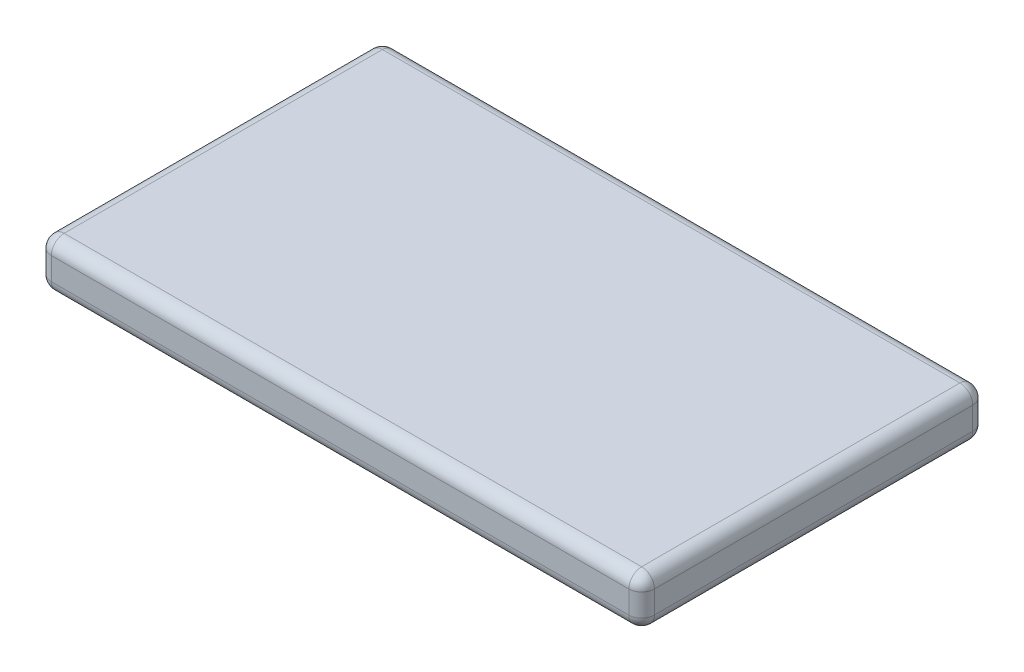
ISO-10303-21;
HEADER;
FILE_DESCRIPTION(('STEP AP214'),'2;1');
FILE_NAME('part.step','',(''),(''),'','','');
FILE_SCHEMA(('AUTOMOTIVE_DESIGN { 1 0 10303 214 1 1 1 1 }'));
ENDSEC;
DATA;
#1=APPLICATION_CONTEXT('core data for automotive mechanical design processes');
#2=APPLICATION_PROTOCOL_DEFINITION('international standard','automotive_design',2000,#1);
#3=PRODUCT_CONTEXT('',#1,'mechanical');
#4=PRODUCT('Part','Part','',(#3));
#5=PRODUCT_RELATED_PRODUCT_CATEGORY('part','',(#4));
#6=PRODUCT_DEFINITION_FORMATION('','',#4);
#7=PRODUCT_DEFINITION_CONTEXT('part definition',#1,'design');
#8=PRODUCT_DEFINITION('design','',#6,#7);
#9=PRODUCT_DEFINITION_SHAPE('','',#8);
#10=(LENGTH_UNIT() NAMED_UNIT(*) SI_UNIT(.MILLI.,.METRE.));
#11=(NAMED_UNIT(*) PLANE_ANGLE_UNIT() SI_UNIT($,.RADIAN.));
#12=(NAMED_UNIT(*) SI_UNIT($,.STERADIAN.) SOLID_ANGLE_UNIT());
#13=UNCERTAINTY_MEASURE_WITH_UNIT(LENGTH_MEASURE(1.E-05),#10,'distance_accuracy_value','');
#14=(GEOMETRIC_REPRESENTATION_CONTEXT(3) GLOBAL_UNCERTAINTY_ASSIGNED_CONTEXT((#13)) GLOBAL_UNIT_ASSIGNED_CONTEXT((#10,
#11,#12)) REPRESENTATION_CONTEXT('',''));
#15=CARTESIAN_POINT('',(0.,0.,0.));
#16=DIRECTION('',(0.,0.,1.));
#17=DIRECTION('',(1.,0.,0.));
#18=AXIS2_PLACEMENT_3D('',#15,#16,#17);
#19=CARTESIAN_POINT('',(0.,4.7752,0.));
#20=DIRECTION('',(1.,0.,0.));
#21=DIRECTION('',(0.,0.,-1.));
#22=AXIS2_PLACEMENT_3D('',#19,#20,#21);
#23=PLANE('',#22);
#24=DIRECTION('',(0.,0.,1.));
#25=VECTOR('',#24,1.);
#26=CARTESIAN_POINT('',(0.,3.5052,0.));
#27=LINE('',#26,#25);
#28=CARTESIAN_POINT('',(0.,3.5052,-1.27));
#29=VERTEX_POINT('',#28);
#30=CARTESIAN_POINT('',(0.,3.5052,-32.766));
#31=VERTEX_POINT('',#30);
#32=EDGE_CURVE('E129',#29,#31,#27,.F.);
#33=ORIENTED_EDGE('',*,*,#32,.T.);
#34=DIRECTION('',(0.,-1.,0.));
#35=VECTOR('',#34,1.);
#36=CARTESIAN_POINT('',(0.,4.7752,-32.766));
#37=LINE('',#36,#35);
#38=CARTESIAN_POINT('',(0.,1.27,-32.766));
#39=VERTEX_POINT('',#38);
#40=EDGE_CURVE('E165',#31,#39,#37,.T.);
#41=ORIENTED_EDGE('',*,*,#40,.T.);
#42=DIRECTION('',(0.,0.,1.));
#43=VECTOR('',#42,1.);
#44=CARTESIAN_POINT('',(0.,1.27,0.));
#45=LINE('',#44,#43);
#46=CARTESIAN_POINT('',(0.,1.27,-1.27));
#47=VERTEX_POINT('',#46);
#48=EDGE_CURVE('E158',#39,#47,#45,.T.);
#49=ORIENTED_EDGE('',*,*,#48,.T.);
#50=DIRECTION('',(0.,-1.,0.));
#51=VECTOR('',#50,1.);
#52=CARTESIAN_POINT('',(0.,4.7752,-1.27));
#53=LINE('',#52,#51);
#54=EDGE_CURVE('E156',#47,#29,#53,.F.);
#55=ORIENTED_EDGE('',*,*,#54,.T.);
#56=EDGE_LOOP('',(#33,#41,#49,#55));
#57=FACE_BOUND('',#56,.T.);
#58=ADVANCED_FACE('F33',(#57),#23,.F.);
#59=CARTESIAN_POINT('',(0.,4.7752,0.));
#60=DIRECTION('',(0.,0.,-1.));
#61=DIRECTION('',(-1.,0.,0.));
#62=AXIS2_PLACEMENT_3D('',#59,#60,#61);
#63=PLANE('',#62);
#64=DIRECTION('',(1.,0.,0.));
#65=VECTOR('',#64,1.);
#66=CARTESIAN_POINT('',(0.,3.5052,0.));
#67=LINE('',#66,#65);
#68=CARTESIAN_POINT('',(58.42,3.5052,0.));
#69=VERTEX_POINT('',#68);
#70=CARTESIAN_POINT('',(1.27,3.5052,0.));
#71=VERTEX_POINT('',#70);
#72=EDGE_CURVE('E42',#69,#71,#67,.F.);
#73=ORIENTED_EDGE('',*,*,#72,.T.);
#74=DIRECTION('',(0.,-1.,0.));
#75=VECTOR('',#74,1.);
#76=CARTESIAN_POINT('',(1.27,4.7752,0.));
#77=LINE('',#76,#75);
#78=CARTESIAN_POINT('',(1.27,1.27,0.));
#79=VERTEX_POINT('',#78);
#80=EDGE_CURVE('E11',#71,#79,#77,.T.);
#81=ORIENTED_EDGE('',*,*,#80,.T.);
#82=DIRECTION('',(1.,0.,0.));
#83=VECTOR('',#82,1.);
#84=CARTESIAN_POINT('',(59.69,1.27,0.));
#85=LINE('',#84,#83);
#86=CARTESIAN_POINT('',(58.42,1.27,0.));
#87=VERTEX_POINT('',#86);
#88=EDGE_CURVE('E194',#79,#87,#85,.T.);
#89=ORIENTED_EDGE('',*,*,#88,.T.);
#90=DIRECTION('',(0.,-1.,0.));
#91=VECTOR('',#90,1.);
#92=CARTESIAN_POINT('',(58.42,4.7752,0.));
#93=LINE('',#92,#91);
#94=EDGE_CURVE('E53',#87,#69,#93,.F.);
#95=ORIENTED_EDGE('',*,*,#94,.T.);
#96=EDGE_LOOP('',(#73,#81,#89,#95));
#97=FACE_BOUND('',#96,.T.);
#98=ADVANCED_FACE('F327',(#97),#63,.F.);
#99=CARTESIAN_POINT('',(59.69,4.7752,0.));
#100=DIRECTION('',(-1.,0.,0.));
#101=DIRECTION('',(0.,0.,1.));
#102=AXIS2_PLACEMENT_3D('',#99,#100,#101);
#103=PLANE('',#102);
#104=DIRECTION('',(0.,-1.,0.));
#105=VECTOR('',#104,1.);
#106=CARTESIAN_POINT('',(59.69,4.7752,-32.766));
#107=LINE('',#106,#105);
#108=CARTESIAN_POINT('',(59.69,1.27,-32.766));
#109=VERTEX_POINT('',#108);
#110=CARTESIAN_POINT('',(59.69,3.5052,-32.766));
#111=VERTEX_POINT('',#110);
#112=EDGE_CURVE('E189',#109,#111,#107,.F.);
#113=ORIENTED_EDGE('',*,*,#112,.T.);
#114=DIRECTION('',(0.,0.,-1.));
#115=VECTOR('',#114,1.);
#116=CARTESIAN_POINT('',(59.69,3.5052,0.));
#117=LINE('',#116,#115);
#118=CARTESIAN_POINT('',(59.69,3.5052,-1.27));
#119=VERTEX_POINT('',#118);
#120=EDGE_CURVE('E191',#111,#119,#117,.F.);
#121=ORIENTED_EDGE('',*,*,#120,.T.);
#122=DIRECTION('',(0.,-1.,0.));
#123=VECTOR('',#122,1.);
#124=CARTESIAN_POINT('',(59.69,4.7752,-1.27));
#125=LINE('',#124,#123);
#126=CARTESIAN_POINT('',(59.69,1.27,-1.27));
#127=VERTEX_POINT('',#126);
#128=EDGE_CURVE('E185',#119,#127,#125,.T.);
#129=ORIENTED_EDGE('',*,*,#128,.T.);
#130=DIRECTION('',(0.,0.,-1.));
#131=VECTOR('',#130,1.);
#132=CARTESIAN_POINT('',(59.69,1.27,-34.036));
#133=LINE('',#132,#131);
#134=EDGE_CURVE('E187',#127,#109,#133,.T.);
#135=ORIENTED_EDGE('',*,*,#134,.T.);
#136=EDGE_LOOP('',(#113,#121,#129,#135));
#137=FACE_BOUND('',#136,.T.);
#138=ADVANCED_FACE('F278',(#137),#103,.F.);
#139=CARTESIAN_POINT('',(0.,4.7752,-34.036));
#140=DIRECTION('',(0.,0.,1.));
#141=DIRECTION('',(1.,0.,0.));
#142=AXIS2_PLACEMENT_3D('',#139,#140,#141);
#143=PLANE('',#142);
#144=DIRECTION('',(0.,-1.,0.));
#145=VECTOR('',#144,1.);
#146=CARTESIAN_POINT('',(1.27,4.7752,-34.036));
#147=LINE('',#146,#145);
#148=CARTESIAN_POINT('',(1.27,1.27,-34.036));
#149=VERTEX_POINT('',#148);
#150=CARTESIAN_POINT('',(1.27,3.5052,-34.036));
#151=VERTEX_POINT('',#150);
#152=EDGE_CURVE('E180',#149,#151,#147,.F.);
#153=ORIENTED_EDGE('',*,*,#152,.T.);
#154=DIRECTION('',(-1.,0.,0.));
#155=VECTOR('',#154,1.);
#156=CARTESIAN_POINT('',(0.,3.5052,-34.036));
#157=LINE('',#156,#155);
#158=CARTESIAN_POINT('',(58.42,3.5052,-34.036));
#159=VERTEX_POINT('',#158);
#160=EDGE_CURVE('E182',#151,#159,#157,.F.);
#161=ORIENTED_EDGE('',*,*,#160,.T.);
#162=DIRECTION('',(0.,-1.,0.));
#163=VECTOR('',#162,1.);
#164=CARTESIAN_POINT('',(58.42,4.7752,-34.036));
#165=LINE('',#164,#163);
#166=CARTESIAN_POINT('',(58.42,1.27,-34.036));
#167=VERTEX_POINT('',#166);
#168=EDGE_CURVE('E176',#159,#167,#165,.T.);
#169=ORIENTED_EDGE('',*,*,#168,.T.);
#170=DIRECTION('',(-1.,0.,0.));
#171=VECTOR('',#170,1.);
#172=CARTESIAN_POINT('',(0.,1.27,-34.036));
#173=LINE('',#172,#171);
#174=EDGE_CURVE('E178',#167,#149,#173,.T.);
#175=ORIENTED_EDGE('',*,*,#174,.T.);
#176=EDGE_LOOP('',(#153,#161,#169,#175));
#177=FACE_BOUND('',#176,.T.);
#178=ADVANCED_FACE('F269',(#177),#143,.F.);
#179=CARTESIAN_POINT('',(0.,4.7752,0.));
#180=DIRECTION('',(0.,-1.,0.));
#181=DIRECTION('',(0.,0.,-1.));
#182=AXIS2_PLACEMENT_3D('',#179,#180,#181);
#183=PLANE('',#182);
#184=DIRECTION('',(-1.,0.,0.));
#185=VECTOR('',#184,1.);
#186=CARTESIAN_POINT('',(0.,4.7752,-32.766));
#187=LINE('',#186,#185);
#188=CARTESIAN_POINT('',(58.42,4.7752,-32.766));
#189=VERTEX_POINT('',#188);
#190=CARTESIAN_POINT('',(1.27,4.7752,-32.766));
#191=VERTEX_POINT('',#190);
#192=EDGE_CURVE('E154',#189,#191,#187,.T.);
#193=ORIENTED_EDGE('',*,*,#192,.T.);
#194=DIRECTION('',(0.,0.,1.));
#195=VECTOR('',#194,1.);
#196=CARTESIAN_POINT('',(1.27,4.7752,0.));
#197=LINE('',#196,#195);
#198=CARTESIAN_POINT('',(1.27,4.7752,-1.27));
#199=VERTEX_POINT('',#198);
#200=EDGE_CURVE('E127',#191,#199,#197,.T.);
#201=ORIENTED_EDGE('',*,*,#200,.T.);
#202=DIRECTION('',(1.,0.,0.));
#203=VECTOR('',#202,1.);
#204=CARTESIAN_POINT('',(0.,4.7752,-1.27));
#205=LINE('',#204,#203);
#206=CARTESIAN_POINT('',(58.42,4.7752,-1.27));
#207=VERTEX_POINT('',#206);
#208=EDGE_CURVE('E144',#199,#207,#205,.T.);
#209=ORIENTED_EDGE('',*,*,#208,.T.);
#210=DIRECTION('',(0.,0.,-1.));
#211=VECTOR('',#210,1.);
#212=CARTESIAN_POINT('',(58.42,4.7752,0.));
#213=LINE('',#212,#211);
#214=EDGE_CURVE('E150',#207,#189,#213,.T.);
#215=ORIENTED_EDGE('',*,*,#214,.T.);
#216=EDGE_LOOP('',(#193,#201,#209,#215));
#217=FACE_BOUND('',#216,.T.);
#218=ADVANCED_FACE('F152',(#217),#183,.F.);
#219=CARTESIAN_POINT('',(0.,0.,0.));
#220=DIRECTION('',(0.,-1.,0.));
#221=DIRECTION('',(0.,0.,-1.));
#222=AXIS2_PLACEMENT_3D('',#219,#220,#221);
#223=PLANE('',#222);
#224=DIRECTION('',(1.,0.,0.));
#225=VECTOR('',#224,1.);
#226=CARTESIAN_POINT('',(0.,0.,-1.27));
#227=LINE('',#226,#225);
#228=CARTESIAN_POINT('',(58.42,0.,-1.27));
#229=VERTEX_POINT('',#228);
#230=CARTESIAN_POINT('',(1.27,0.,-1.27));
#231=VERTEX_POINT('',#230);
#232=EDGE_CURVE('E167',#229,#231,#227,.F.);
#233=ORIENTED_EDGE('',*,*,#232,.T.);
#234=DIRECTION('',(0.,0.,1.));
#235=VECTOR('',#234,1.);
#236=CARTESIAN_POINT('',(1.27,0.,-34.036));
#237=LINE('',#236,#235);
#238=CARTESIAN_POINT('',(1.27,0.,-32.766));
#239=VERTEX_POINT('',#238);
#240=EDGE_CURVE('E173',#231,#239,#237,.F.);
#241=ORIENTED_EDGE('',*,*,#240,.T.);
#242=DIRECTION('',(-1.,0.,0.));
#243=VECTOR('',#242,1.);
#244=CARTESIAN_POINT('',(59.69,0.,-32.766));
#245=LINE('',#244,#243);
#246=CARTESIAN_POINT('',(58.42,0.,-32.766));
#247=VERTEX_POINT('',#246);
#248=EDGE_CURVE('E171',#239,#247,#245,.F.);
#249=ORIENTED_EDGE('',*,*,#248,.T.);
#250=DIRECTION('',(0.,0.,-1.));
#251=VECTOR('',#250,1.);
#252=CARTESIAN_POINT('',(58.42,0.,0.));
#253=LINE('',#252,#251);
#254=EDGE_CURVE('E169',#247,#229,#253,.F.);
#255=ORIENTED_EDGE('',*,*,#254,.T.);
#256=EDGE_LOOP('',(#233,#241,#249,#255));
#257=FACE_BOUND('',#256,.T.);
#258=ADVANCED_FACE('F296',(#257),#223,.T.);
#259=CARTESIAN_POINT('',(58.42,1.27,0.));
#260=DIRECTION('',(0.,0.,1.));
#261=DIRECTION('',(1.,0.,0.));
#262=AXIS2_PLACEMENT_3D('',#259,#260,#261);
#263=CYLINDRICAL_SURFACE('',#262,1.27);
#264=CARTESIAN_POINT('',(58.42,1.27,-32.766));
#265=DIRECTION('',(0.,0.,-1.));
#266=DIRECTION('',(-1.,0.,0.));
#267=AXIS2_PLACEMENT_3D('',#264,#265,#266);
#268=CIRCLE('',#267,1.27);
#269=EDGE_CURVE('E37',#109,#247,#268,.T.);
#270=ORIENTED_EDGE('',*,*,#269,.F.);
#271=ORIENTED_EDGE('',*,*,#134,.F.);
#272=CARTESIAN_POINT('',(58.42,1.27,-1.27));
#273=DIRECTION('',(0.,0.,1.));
#274=DIRECTION('',(1.,0.,0.));
#275=AXIS2_PLACEMENT_3D('',#272,#273,#274);
#276=CIRCLE('',#275,1.27);
#277=EDGE_CURVE('E246',#229,#127,#276,.T.);
#278=ORIENTED_EDGE('',*,*,#277,.F.);
#279=ORIENTED_EDGE('',*,*,#254,.F.);
#280=EDGE_LOOP('',(#270,#271,#278,#279));
#281=FACE_BOUND('',#280,.T.);
#282=ADVANCED_FACE('F35',(#281),#263,.T.);
#283=CARTESIAN_POINT('',(58.42,1.27,-32.766));
#284=DIRECTION('',(0.,0.,1.));
#285=DIRECTION('',(1.,0.,0.));
#286=AXIS2_PLACEMENT_3D('',#283,#284,#285);
#287=SPHERICAL_SURFACE('',#286,1.27);
#288=CARTESIAN_POINT('',(58.42,1.27,-32.766));
#289=DIRECTION('',(0.,-1.,0.));
#290=DIRECTION('',(0.,0.,-1.));
#291=AXIS2_PLACEMENT_3D('',#288,#289,#290);
#292=CIRCLE('',#291,1.27);
#293=EDGE_CURVE('E241',#109,#167,#292,.F.);
#294=ORIENTED_EDGE('',*,*,#293,.F.);
#295=ORIENTED_EDGE('',*,*,#269,.T.);
#296=CARTESIAN_POINT('',(58.42,1.27,-32.766));
#297=DIRECTION('',(1.,0.,0.));
#298=DIRECTION('',(0.,0.,-1.));
#299=AXIS2_PLACEMENT_3D('',#296,#297,#298);
#300=CIRCLE('',#299,1.27);
#301=EDGE_CURVE('E244',#167,#247,#300,.F.);
#302=ORIENTED_EDGE('',*,*,#301,.F.);
#303=EDGE_LOOP('',(#294,#295,#302));
#304=FACE_BOUND('',#303,.T.);
#305=ADVANCED_FACE('F257',(#304),#287,.T.);
#306=CARTESIAN_POINT('',(58.42,1.27,-1.27));
#307=DIRECTION('',(0.,0.,1.));
#308=DIRECTION('',(1.,0.,0.));
#309=AXIS2_PLACEMENT_3D('',#306,#307,#308);
#310=SPHERICAL_SURFACE('',#309,1.27);
#311=CARTESIAN_POINT('',(58.42,1.27,-1.27));
#312=DIRECTION('',(1.,0.,0.));
#313=DIRECTION('',(0.,0.,-1.));
#314=AXIS2_PLACEMENT_3D('',#311,#312,#313);
#315=CIRCLE('',#314,1.27);
#316=EDGE_CURVE('E235',#229,#87,#315,.F.);
#317=ORIENTED_EDGE('',*,*,#316,.F.);
#318=ORIENTED_EDGE('',*,*,#277,.T.);
#319=CARTESIAN_POINT('',(58.42,1.27,-1.27));
#320=DIRECTION('',(0.,-1.,0.));
#321=DIRECTION('',(0.,0.,-1.));
#322=AXIS2_PLACEMENT_3D('',#319,#320,#321);
#323=CIRCLE('',#322,1.27);
#324=EDGE_CURVE('E238',#87,#127,#323,.F.);
#325=ORIENTED_EDGE('',*,*,#324,.F.);
#326=EDGE_LOOP('',(#317,#318,#325));
#327=FACE_BOUND('',#326,.T.);
#328=ADVANCED_FACE('F289',(#327),#310,.T.);
#329=CARTESIAN_POINT('',(0.,1.27,-32.766));
#330=DIRECTION('',(1.,0.,0.));
#331=DIRECTION('',(0.,0.,-1.));
#332=AXIS2_PLACEMENT_3D('',#329,#330,#331);
#333=CYLINDRICAL_SURFACE('',#332,1.27);
#334=ORIENTED_EDGE('',*,*,#301,.T.);
#335=ORIENTED_EDGE('',*,*,#248,.F.);
#336=CARTESIAN_POINT('',(1.27,1.27,-32.766));
#337=DIRECTION('',(-1.,0.,0.));
#338=DIRECTION('',(0.,0.,1.));
#339=AXIS2_PLACEMENT_3D('',#336,#337,#338);
#340=CIRCLE('',#339,1.27);
#341=EDGE_CURVE('E230',#149,#239,#340,.T.);
#342=ORIENTED_EDGE('',*,*,#341,.F.);
#343=ORIENTED_EDGE('',*,*,#174,.F.);
#344=EDGE_LOOP('',(#334,#335,#342,#343));
#345=FACE_BOUND('',#344,.T.);
#346=ADVANCED_FACE('F265',(#345),#333,.T.);
#347=CARTESIAN_POINT('',(58.42,4.7752,-32.766));
#348=DIRECTION('',(0.,-1.,0.));
#349=DIRECTION('',(0.,0.,-1.));
#350=AXIS2_PLACEMENT_3D('',#347,#348,#349);
#351=CYLINDRICAL_SURFACE('',#350,1.27);
#352=ORIENTED_EDGE('',*,*,#293,.T.);
#353=ORIENTED_EDGE('',*,*,#168,.F.);
#354=CARTESIAN_POINT('',(58.42,3.5052,-32.766));
#355=DIRECTION('',(0.,1.,0.));
#356=DIRECTION('',(0.,0.,1.));
#357=AXIS2_PLACEMENT_3D('',#354,#355,#356);
#358=CIRCLE('',#357,1.27);
#359=EDGE_CURVE('E227',#111,#159,#358,.T.);
#360=ORIENTED_EDGE('',*,*,#359,.F.);
#361=ORIENTED_EDGE('',*,*,#112,.F.);
#362=EDGE_LOOP('',(#352,#353,#360,#361));
#363=FACE_BOUND('',#362,.T.);
#364=ADVANCED_FACE('F275',(#363),#351,.T.);
#365=CARTESIAN_POINT('',(58.42,3.5052,0.));
#366=DIRECTION('',(0.,0.,-1.));
#367=DIRECTION('',(-1.,0.,0.));
#368=AXIS2_PLACEMENT_3D('',#365,#366,#367);
#369=CYLINDRICAL_SURFACE('',#368,1.27);
#370=CARTESIAN_POINT('',(58.42,3.5052,-1.27));
#371=DIRECTION('',(0.,0.,1.));
#372=DIRECTION('',(1.,0.,0.));
#373=AXIS2_PLACEMENT_3D('',#370,#371,#372);
#374=CIRCLE('',#373,1.27);
#375=EDGE_CURVE('E221',#119,#207,#374,.T.);
#376=ORIENTED_EDGE('',*,*,#375,.F.);
#377=ORIENTED_EDGE('',*,*,#120,.F.);
#378=CARTESIAN_POINT('',(58.42,3.5052,-32.766));
#379=DIRECTION('',(0.,0.,-1.));
#380=DIRECTION('',(-1.,0.,0.));
#381=AXIS2_PLACEMENT_3D('',#378,#379,#380);
#382=CIRCLE('',#381,1.27);
#383=EDGE_CURVE('E224',#189,#111,#382,.T.);
#384=ORIENTED_EDGE('',*,*,#383,.F.);
#385=ORIENTED_EDGE('',*,*,#214,.F.);
#386=EDGE_LOOP('',(#376,#377,#384,#385));
#387=FACE_BOUND('',#386,.T.);
#388=ADVANCED_FACE('F282',(#387),#369,.T.);
#389=CARTESIAN_POINT('',(58.42,4.7752,-1.27));
#390=DIRECTION('',(0.,-1.,0.));
#391=DIRECTION('',(0.,0.,-1.));
#392=AXIS2_PLACEMENT_3D('',#389,#390,#391);
#393=CYLINDRICAL_SURFACE('',#392,1.27);
#394=ORIENTED_EDGE('',*,*,#324,.T.);
#395=ORIENTED_EDGE('',*,*,#128,.F.);
#396=CARTESIAN_POINT('',(58.42,3.5052,-1.27));
#397=DIRECTION('',(0.,1.,0.));
#398=DIRECTION('',(0.,0.,1.));
#399=AXIS2_PLACEMENT_3D('',#396,#397,#398);
#400=CIRCLE('',#399,1.27);
#401=EDGE_CURVE('E219',#69,#119,#400,.T.);
#402=ORIENTED_EDGE('',*,*,#401,.F.);
#403=ORIENTED_EDGE('',*,*,#94,.F.);
#404=EDGE_LOOP('',(#394,#395,#402,#403));
#405=FACE_BOUND('',#404,.T.);
#406=ADVANCED_FACE('F287',(#405),#393,.T.);
#407=CARTESIAN_POINT('',(0.,1.27,-1.27));
#408=DIRECTION('',(-1.,0.,0.));
#409=DIRECTION('',(0.,0.,1.));
#410=AXIS2_PLACEMENT_3D('',#407,#408,#409);
#411=CYLINDRICAL_SURFACE('',#410,1.27);
#412=ORIENTED_EDGE('',*,*,#316,.T.);
#413=ORIENTED_EDGE('',*,*,#88,.F.);
#414=CARTESIAN_POINT('',(1.27,1.27,-1.27));
#415=DIRECTION('',(-1.,0.,0.));
#416=DIRECTION('',(0.,0.,1.));
#417=AXIS2_PLACEMENT_3D('',#414,#415,#416);
#418=CIRCLE('',#417,1.27);
#419=EDGE_CURVE('E216',#231,#79,#418,.T.);
#420=ORIENTED_EDGE('',*,*,#419,.F.);
#421=ORIENTED_EDGE('',*,*,#232,.F.);
#422=EDGE_LOOP('',(#412,#413,#420,#421));
#423=FACE_BOUND('',#422,.T.);
#424=ADVANCED_FACE('F293',(#423),#411,.T.);
#425=CARTESIAN_POINT('',(1.27,1.27,0.));
#426=DIRECTION('',(0.,0.,-1.));
#427=DIRECTION('',(-1.,0.,0.));
#428=AXIS2_PLACEMENT_3D('',#425,#426,#427);
#429=CYLINDRICAL_SURFACE('',#428,1.27);
#430=CARTESIAN_POINT('',(1.27,1.27,-32.766));
#431=DIRECTION('',(0.,0.,-1.));
#432=DIRECTION('',(-1.,0.,0.));
#433=AXIS2_PLACEMENT_3D('',#430,#431,#432);
#434=CIRCLE('',#433,1.27);
#435=EDGE_CURVE('E232',#239,#39,#434,.T.);
#436=ORIENTED_EDGE('',*,*,#435,.F.);
#437=ORIENTED_EDGE('',*,*,#240,.F.);
#438=CARTESIAN_POINT('',(1.27,1.27,-1.27));
#439=DIRECTION('',(0.,0.,1.));
#440=DIRECTION('',(1.,0.,0.));
#441=AXIS2_PLACEMENT_3D('',#438,#439,#440);
#442=CIRCLE('',#441,1.27);
#443=EDGE_CURVE('E213',#47,#231,#442,.T.);
#444=ORIENTED_EDGE('',*,*,#443,.F.);
#445=ORIENTED_EDGE('',*,*,#48,.F.);
#446=EDGE_LOOP('',(#436,#437,#444,#445));
#447=FACE_BOUND('',#446,.T.);
#448=ADVANCED_FACE('F300',(#447),#429,.T.);
#449=CARTESIAN_POINT('',(1.27,1.27,-32.766));
#450=DIRECTION('',(0.,0.,1.));
#451=DIRECTION('',(1.,0.,0.));
#452=AXIS2_PLACEMENT_3D('',#449,#450,#451);
#453=SPHERICAL_SURFACE('',#452,1.27);
#454=ORIENTED_EDGE('',*,*,#341,.T.);
#455=ORIENTED_EDGE('',*,*,#435,.T.);
#456=CARTESIAN_POINT('',(1.27,1.27,-32.766));
#457=DIRECTION('',(0.,-1.,0.));
#458=DIRECTION('',(0.,0.,-1.));
#459=AXIS2_PLACEMENT_3D('',#456,#457,#458);
#460=CIRCLE('',#459,1.27);
#461=EDGE_CURVE('E210',#149,#39,#460,.F.);
#462=ORIENTED_EDGE('',*,*,#461,.F.);
#463=EDGE_LOOP('',(#454,#455,#462));
#464=FACE_BOUND('',#463,.T.);
#465=ADVANCED_FACE('F304',(#464),#453,.T.);
#466=CARTESIAN_POINT('',(58.42,3.5052,-32.766));
#467=DIRECTION('',(0.,0.,1.));
#468=DIRECTION('',(1.,0.,0.));
#469=AXIS2_PLACEMENT_3D('',#466,#467,#468);
#470=SPHERICAL_SURFACE('',#469,1.27);
#471=ORIENTED_EDGE('',*,*,#383,.T.);
#472=ORIENTED_EDGE('',*,*,#359,.T.);
#473=CARTESIAN_POINT('',(58.42,3.5052,-32.766));
#474=DIRECTION('',(1.,0.,0.));
#475=DIRECTION('',(0.,0.,-1.));
#476=AXIS2_PLACEMENT_3D('',#473,#474,#475);
#477=CIRCLE('',#476,1.27);
#478=EDGE_CURVE('E208',#189,#159,#477,.F.);
#479=ORIENTED_EDGE('',*,*,#478,.F.);
#480=EDGE_LOOP('',(#471,#472,#479));
#481=FACE_BOUND('',#480,.T.);
#482=ADVANCED_FACE('F315',(#481),#470,.T.);
#483=CARTESIAN_POINT('',(58.42,3.5052,-1.27));
#484=DIRECTION('',(0.,0.,1.));
#485=DIRECTION('',(1.,0.,0.));
#486=AXIS2_PLACEMENT_3D('',#483,#484,#485);
#487=SPHERICAL_SURFACE('',#486,1.27);
#488=ORIENTED_EDGE('',*,*,#401,.T.);
#489=ORIENTED_EDGE('',*,*,#375,.T.);
#490=CARTESIAN_POINT('',(58.42,3.5052,-1.27));
#491=DIRECTION('',(1.,0.,0.));
#492=DIRECTION('',(0.,0.,-1.));
#493=AXIS2_PLACEMENT_3D('',#490,#491,#492);
#494=CIRCLE('',#493,1.27);
#495=EDGE_CURVE('E147',#69,#207,#494,.F.);
#496=ORIENTED_EDGE('',*,*,#495,.F.);
#497=EDGE_LOOP('',(#488,#489,#496));
#498=FACE_BOUND('',#497,.T.);
#499=ADVANCED_FACE('F317',(#498),#487,.T.);
#500=CARTESIAN_POINT('',(1.27,1.27,-1.27));
#501=DIRECTION('',(0.,0.,1.));
#502=DIRECTION('',(1.,0.,0.));
#503=AXIS2_PLACEMENT_3D('',#500,#501,#502);
#504=SPHERICAL_SURFACE('',#503,1.27);
#505=ORIENTED_EDGE('',*,*,#443,.T.);
#506=ORIENTED_EDGE('',*,*,#419,.T.);
#507=CARTESIAN_POINT('',(1.27,1.27,-1.27));
#508=DIRECTION('',(0.,-1.,0.));
#509=DIRECTION('',(0.,0.,-1.));
#510=AXIS2_PLACEMENT_3D('',#507,#508,#509);
#511=CIRCLE('',#510,1.27);
#512=EDGE_CURVE('E205',#47,#79,#511,.F.);
#513=ORIENTED_EDGE('',*,*,#512,.F.);
#514=EDGE_LOOP('',(#505,#506,#513));
#515=FACE_BOUND('',#514,.T.);
#516=ADVANCED_FACE('F323',(#515),#504,.T.);
#517=CARTESIAN_POINT('',(1.27,4.7752,-32.766));
#518=DIRECTION('',(0.,-1.,0.));
#519=DIRECTION('',(0.,0.,-1.));
#520=AXIS2_PLACEMENT_3D('',#517,#518,#519);
#521=CYLINDRICAL_SURFACE('',#520,1.27);
#522=ORIENTED_EDGE('',*,*,#461,.T.);
#523=ORIENTED_EDGE('',*,*,#40,.F.);
#524=CARTESIAN_POINT('',(1.27,3.5052,-32.766));
#525=DIRECTION('',(0.,1.,0.));
#526=DIRECTION('',(0.,0.,1.));
#527=AXIS2_PLACEMENT_3D('',#524,#525,#526);
#528=CIRCLE('',#527,1.27);
#529=EDGE_CURVE('E202',#151,#31,#528,.T.);
#530=ORIENTED_EDGE('',*,*,#529,.F.);
#531=ORIENTED_EDGE('',*,*,#152,.F.);
#532=EDGE_LOOP('',(#522,#523,#530,#531));
#533=FACE_BOUND('',#532,.T.);
#534=ADVANCED_FACE('F307',(#533),#521,.T.);
#535=CARTESIAN_POINT('',(0.,3.5052,-32.766));
#536=DIRECTION('',(-1.,0.,0.));
#537=DIRECTION('',(0.,0.,1.));
#538=AXIS2_PLACEMENT_3D('',#535,#536,#537);
#539=CYLINDRICAL_SURFACE('',#538,1.27);
#540=ORIENTED_EDGE('',*,*,#478,.T.);
#541=ORIENTED_EDGE('',*,*,#160,.F.);
#542=CARTESIAN_POINT('',(1.27,3.5052,-32.766));
#543=DIRECTION('',(-1.,0.,0.));
#544=DIRECTION('',(0.,0.,1.));
#545=AXIS2_PLACEMENT_3D('',#542,#543,#544);
#546=CIRCLE('',#545,1.27);
#547=EDGE_CURVE('E141',#191,#151,#546,.T.);
#548=ORIENTED_EDGE('',*,*,#547,.F.);
#549=ORIENTED_EDGE('',*,*,#192,.F.);
#550=EDGE_LOOP('',(#540,#541,#548,#549));
#551=FACE_BOUND('',#550,.T.);
#552=ADVANCED_FACE('F313',(#551),#539,.T.);
#553=CARTESIAN_POINT('',(0.,3.5052,-1.27));
#554=DIRECTION('',(1.,0.,0.));
#555=DIRECTION('',(0.,0.,-1.));
#556=AXIS2_PLACEMENT_3D('',#553,#554,#555);
#557=CYLINDRICAL_SURFACE('',#556,1.27);
#558=ORIENTED_EDGE('',*,*,#495,.T.);
#559=ORIENTED_EDGE('',*,*,#208,.F.);
#560=CARTESIAN_POINT('',(1.27,3.5052,-1.27));
#561=DIRECTION('',(-1.,0.,0.));
#562=DIRECTION('',(0.,0.,1.));
#563=AXIS2_PLACEMENT_3D('',#560,#561,#562);
#564=CIRCLE('',#563,1.27);
#565=EDGE_CURVE('E135',#71,#199,#564,.T.);
#566=ORIENTED_EDGE('',*,*,#565,.F.);
#567=ORIENTED_EDGE('',*,*,#72,.F.);
#568=EDGE_LOOP('',(#558,#559,#566,#567));
#569=FACE_BOUND('',#568,.T.);
#570=ADVANCED_FACE('F145',(#569),#557,.T.);
#571=CARTESIAN_POINT('',(1.27,4.7752,-1.27));
#572=DIRECTION('',(0.,-1.,0.));
#573=DIRECTION('',(0.,0.,-1.));
#574=AXIS2_PLACEMENT_3D('',#571,#572,#573);
#575=CYLINDRICAL_SURFACE('',#574,1.27);
#576=ORIENTED_EDGE('',*,*,#512,.T.);
#577=ORIENTED_EDGE('',*,*,#80,.F.);
#578=CARTESIAN_POINT('',(1.27,3.5052,-1.27));
#579=DIRECTION('',(0.,1.,0.));
#580=DIRECTION('',(0.,0.,1.));
#581=AXIS2_PLACEMENT_3D('',#578,#579,#580);
#582=CIRCLE('',#581,1.27);
#583=EDGE_CURVE('E139',#29,#71,#582,.T.);
#584=ORIENTED_EDGE('',*,*,#583,.F.);
#585=ORIENTED_EDGE('',*,*,#54,.F.);
#586=EDGE_LOOP('',(#576,#577,#584,#585));
#587=FACE_BOUND('',#586,.T.);
#588=ADVANCED_FACE('F342',(#587),#575,.T.);
#589=CARTESIAN_POINT('',(1.27,3.5052,-32.766));
#590=DIRECTION('',(0.,0.,1.));
#591=DIRECTION('',(1.,0.,0.));
#592=AXIS2_PLACEMENT_3D('',#589,#590,#591);
#593=SPHERICAL_SURFACE('',#592,1.27);
#594=ORIENTED_EDGE('',*,*,#547,.T.);
#595=ORIENTED_EDGE('',*,*,#529,.T.);
#596=CARTESIAN_POINT('',(1.27,3.5052,-32.766));
#597=DIRECTION('',(0.,0.,-1.));
#598=DIRECTION('',(-1.,0.,0.));
#599=AXIS2_PLACEMENT_3D('',#596,#597,#598);
#600=CIRCLE('',#599,1.27);
#601=EDGE_CURVE('E132',#191,#31,#600,.F.);
#602=ORIENTED_EDGE('',*,*,#601,.F.);
#603=EDGE_LOOP('',(#594,#595,#602));
#604=FACE_BOUND('',#603,.T.);
#605=ADVANCED_FACE('F311',(#604),#593,.T.);
#606=CARTESIAN_POINT('',(1.27,3.5052,-1.27));
#607=DIRECTION('',(0.,0.,1.));
#608=DIRECTION('',(1.,0.,0.));
#609=AXIS2_PLACEMENT_3D('',#606,#607,#608);
#610=SPHERICAL_SURFACE('',#609,1.27);
#611=ORIENTED_EDGE('',*,*,#583,.T.);
#612=ORIENTED_EDGE('',*,*,#565,.T.);
#613=CARTESIAN_POINT('',(1.27,3.5052,-1.27));
#614=DIRECTION('',(0.,0.,1.));
#615=DIRECTION('',(1.,0.,0.));
#616=AXIS2_PLACEMENT_3D('',#613,#614,#615);
#617=CIRCLE('',#616,1.27);
#618=EDGE_CURVE('E123',#29,#199,#617,.F.);
#619=ORIENTED_EDGE('',*,*,#618,.F.);
#620=EDGE_LOOP('',(#611,#612,#619));
#621=FACE_BOUND('',#620,.T.);
#622=ADVANCED_FACE('F137',(#621),#610,.T.);
#623=CARTESIAN_POINT('',(1.27,3.5052,0.));
#624=DIRECTION('',(0.,0.,1.));
#625=DIRECTION('',(1.,0.,0.));
#626=AXIS2_PLACEMENT_3D('',#623,#624,#625);
#627=CYLINDRICAL_SURFACE('',#626,1.27);
#628=ORIENTED_EDGE('',*,*,#601,.T.);
#629=ORIENTED_EDGE('',*,*,#32,.F.);
#630=ORIENTED_EDGE('',*,*,#618,.T.);
#631=ORIENTED_EDGE('',*,*,#200,.F.);
#632=EDGE_LOOP('',(#628,#629,#630,#631));
#633=FACE_BOUND('',#632,.T.);
#634=ADVANCED_FACE('F125',(#633),#627,.T.);
#635=CLOSED_SHELL('',(#58,#98,#138,#178,#218,#258,#282,#305,#328,#346,#364,#388,#406,#424,#448,
#465,#482,#499,#516,#534,#552,#570,#588,#605,#622,#634));
#636=MANIFOLD_SOLID_BREP('B2',#635);
#637=ADVANCED_BREP_SHAPE_REPRESENTATION('',(#18,#636),#14);
#638=SHAPE_DEFINITION_REPRESENTATION(#9,#637);
ENDSEC;
END-ISO-10303-21;
